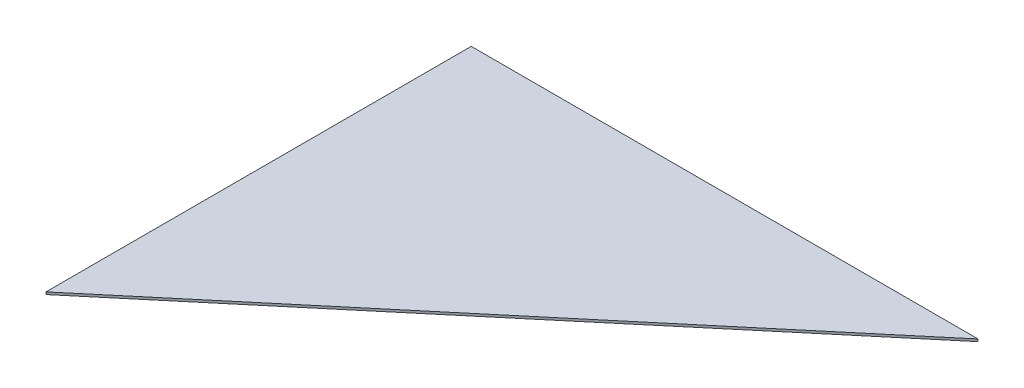
ISO-10303-21;
HEADER;
FILE_DESCRIPTION(('STEP AP214'),'2;1');
FILE_NAME('part.step','',(''),(''),'','','');
FILE_SCHEMA(('AUTOMOTIVE_DESIGN { 1 0 10303 214 1 1 1 1 }'));
ENDSEC;
DATA;
#1=APPLICATION_CONTEXT('core data for automotive mechanical design processes');
#2=APPLICATION_PROTOCOL_DEFINITION('international standard','automotive_design',2000,#1);
#3=PRODUCT_CONTEXT('',#1,'mechanical');
#4=PRODUCT('Part','Part','',(#3));
#5=PRODUCT_RELATED_PRODUCT_CATEGORY('part','',(#4));
#6=PRODUCT_DEFINITION_FORMATION('','',#4);
#7=PRODUCT_DEFINITION_CONTEXT('part definition',#1,'design');
#8=PRODUCT_DEFINITION('design','',#6,#7);
#9=PRODUCT_DEFINITION_SHAPE('','',#8);
#10=(LENGTH_UNIT() NAMED_UNIT(*) SI_UNIT(.MILLI.,.METRE.));
#11=(NAMED_UNIT(*) PLANE_ANGLE_UNIT() SI_UNIT($,.RADIAN.));
#12=(NAMED_UNIT(*) SI_UNIT($,.STERADIAN.) SOLID_ANGLE_UNIT());
#13=UNCERTAINTY_MEASURE_WITH_UNIT(LENGTH_MEASURE(1.E-05),#10,'distance_accuracy_value','');
#14=(GEOMETRIC_REPRESENTATION_CONTEXT(3) GLOBAL_UNCERTAINTY_ASSIGNED_CONTEXT((#13)) GLOBAL_UNIT_ASSIGNED_CONTEXT((#10,
#11,#12)) REPRESENTATION_CONTEXT('',''));
#15=CARTESIAN_POINT('',(0.,0.,0.));
#16=DIRECTION('',(0.,0.,1.));
#17=DIRECTION('',(1.,0.,0.));
#18=AXIS2_PLACEMENT_3D('',#15,#16,#17);
#19=CARTESIAN_POINT('',(553.75474691391,-6.35,574.675));
#20=DIRECTION('',(-1.,0.,0.));
#21=DIRECTION('',(0.,0.,1.));
#22=AXIS2_PLACEMENT_3D('',#19,#20,#21);
#23=PLANE('',#22);
#24=DIRECTION('',(0.,0.,1.));
#25=VECTOR('',#24,1.);
#26=CARTESIAN_POINT('',(553.75474691391,0.,574.675));
#27=LINE('',#26,#25);
#28=CARTESIAN_POINT('',(553.75474691391,0.,0.));
#29=VERTEX_POINT('',#28);
#30=CARTESIAN_POINT('',(553.75474691391,0.,1149.35));
#31=VERTEX_POINT('',#30);
#32=EDGE_CURVE('E62',#29,#31,#27,.T.);
#33=ORIENTED_EDGE('',*,*,#32,.F.);
#34=DIRECTION('',(0.,1.,0.));
#35=VECTOR('',#34,1.);
#36=CARTESIAN_POINT('',(553.75474691391,-6.35,0.));
#37=LINE('',#36,#35);
#38=CARTESIAN_POINT('',(553.75474691391,-6.35,0.));
#39=VERTEX_POINT('',#38);
#40=EDGE_CURVE('E11',#39,#29,#37,.T.);
#41=ORIENTED_EDGE('',*,*,#40,.F.);
#42=DIRECTION('',(0.,0.,1.));
#43=VECTOR('',#42,1.);
#44=CARTESIAN_POINT('',(553.75474691391,-6.35,574.675));
#45=LINE('',#44,#43);
#46=CARTESIAN_POINT('',(553.75474691391,-6.35,1149.35));
#47=VERTEX_POINT('',#46);
#48=EDGE_CURVE('E60',#39,#47,#45,.T.);
#49=ORIENTED_EDGE('',*,*,#48,.T.);
#50=DIRECTION('',(0.,1.,0.));
#51=VECTOR('',#50,1.);
#52=CARTESIAN_POINT('',(553.75474691391,-6.35,1149.35));
#53=LINE('',#52,#51);
#54=EDGE_CURVE('E38',#47,#31,#53,.T.);
#55=ORIENTED_EDGE('',*,*,#54,.T.);
#56=EDGE_LOOP('',(#33,#41,#49,#55));
#57=FACE_BOUND('',#56,.T.);
#58=ADVANCED_FACE('F16',(#57),#23,.T.);
#59=CARTESIAN_POINT('',(1238.62574273799,-6.35,0.));
#60=DIRECTION('',(0.,0.,-1.));
#61=DIRECTION('',(-1.,0.,0.));
#62=AXIS2_PLACEMENT_3D('',#59,#60,#61);
#63=PLANE('',#62);
#64=DIRECTION('',(-1.,0.,0.));
#65=VECTOR('',#64,1.);
#66=CARTESIAN_POINT('',(1238.62574273799,0.,0.));
#67=LINE('',#66,#65);
#68=CARTESIAN_POINT('',(1923.49673856207,0.,-2.20388805938073E-13));
#69=VERTEX_POINT('',#68);
#70=EDGE_CURVE('E85',#69,#29,#67,.T.);
#71=ORIENTED_EDGE('',*,*,#70,.F.);
#72=DIRECTION('',(0.,1.,0.));
#73=VECTOR('',#72,1.);
#74=CARTESIAN_POINT('',(1923.49673856207,-6.35,-2.20388805938073E-13));
#75=LINE('',#74,#73);
#76=CARTESIAN_POINT('',(1923.49673856207,-6.35,-2.20388805938073E-13));
#77=VERTEX_POINT('',#76);
#78=EDGE_CURVE('E25',#77,#69,#75,.T.);
#79=ORIENTED_EDGE('',*,*,#78,.F.);
#80=DIRECTION('',(-1.,0.,0.));
#81=VECTOR('',#80,1.);
#82=CARTESIAN_POINT('',(1238.62574273799,-6.35,0.));
#83=LINE('',#82,#81);
#84=EDGE_CURVE('E69',#77,#39,#83,.T.);
#85=ORIENTED_EDGE('',*,*,#84,.T.);
#86=ORIENTED_EDGE('',*,*,#40,.T.);
#87=EDGE_LOOP('',(#71,#79,#85,#86));
#88=FACE_BOUND('',#87,.T.);
#89=ADVANCED_FACE('F74',(#88),#63,.T.);
#90=CARTESIAN_POINT('',(1238.62574273799,-6.35,574.675));
#91=DIRECTION('',(0.642787609686539,0.,0.766044443118978));
#92=DIRECTION('',(0.766044443118978,0.,-0.642787609686539));
#93=AXIS2_PLACEMENT_3D('',#90,#91,#92);
#94=PLANE('',#93);
#95=DIRECTION('',(0.766044443118978,0.,-0.642787609686539));
#96=VECTOR('',#95,1.);
#97=CARTESIAN_POINT('',(1238.62574273799,0.,574.675));
#98=LINE('',#97,#96);
#99=EDGE_CURVE('E72',#31,#69,#98,.T.);
#100=ORIENTED_EDGE('',*,*,#99,.F.);
#101=ORIENTED_EDGE('',*,*,#54,.F.);
#102=DIRECTION('',(0.766044443118978,0.,-0.642787609686539));
#103=VECTOR('',#102,1.);
#104=CARTESIAN_POINT('',(1238.62574273799,-6.35,574.675));
#105=LINE('',#104,#103);
#106=EDGE_CURVE('E70',#47,#77,#105,.T.);
#107=ORIENTED_EDGE('',*,*,#106,.T.);
#108=ORIENTED_EDGE('',*,*,#78,.T.);
#109=EDGE_LOOP('',(#100,#101,#107,#108));
#110=FACE_BOUND('',#109,.T.);
#111=ADVANCED_FACE('F105',(#110),#94,.T.);
#112=CARTESIAN_POINT('',(1238.62574273799,-6.35,574.675));
#113=DIRECTION('',(0.,-1.,0.));
#114=DIRECTION('',(1.,0.,0.));
#115=AXIS2_PLACEMENT_3D('',#112,#113,#114);
#116=PLANE('',#115);
#117=ORIENTED_EDGE('',*,*,#48,.F.);
#118=ORIENTED_EDGE('',*,*,#84,.F.);
#119=ORIENTED_EDGE('',*,*,#106,.F.);
#120=EDGE_LOOP('',(#117,#118,#119));
#121=FACE_BOUND('',#120,.T.);
#122=ADVANCED_FACE('F68',(#121),#116,.T.);
#123=CARTESIAN_POINT('',(1238.62574273799,0.,574.675));
#124=DIRECTION('',(0.,-1.,0.));
#125=DIRECTION('',(1.,0.,0.));
#126=AXIS2_PLACEMENT_3D('',#123,#124,#125);
#127=PLANE('',#126);
#128=ORIENTED_EDGE('',*,*,#32,.T.);
#129=ORIENTED_EDGE('',*,*,#99,.T.);
#130=ORIENTED_EDGE('',*,*,#70,.T.);
#131=EDGE_LOOP('',(#128,#129,#130));
#132=FACE_BOUND('',#131,.T.);
#133=ADVANCED_FACE('F104',(#132),#127,.F.);
#134=CLOSED_SHELL('',(#58,#89,#111,#122,#133));
#135=MANIFOLD_SOLID_BREP('B1',#134);
#136=ADVANCED_BREP_SHAPE_REPRESENTATION('',(#18,#135),#14);
#137=SHAPE_DEFINITION_REPRESENTATION(#9,#136);
ENDSEC;
END-ISO-10303-21;
